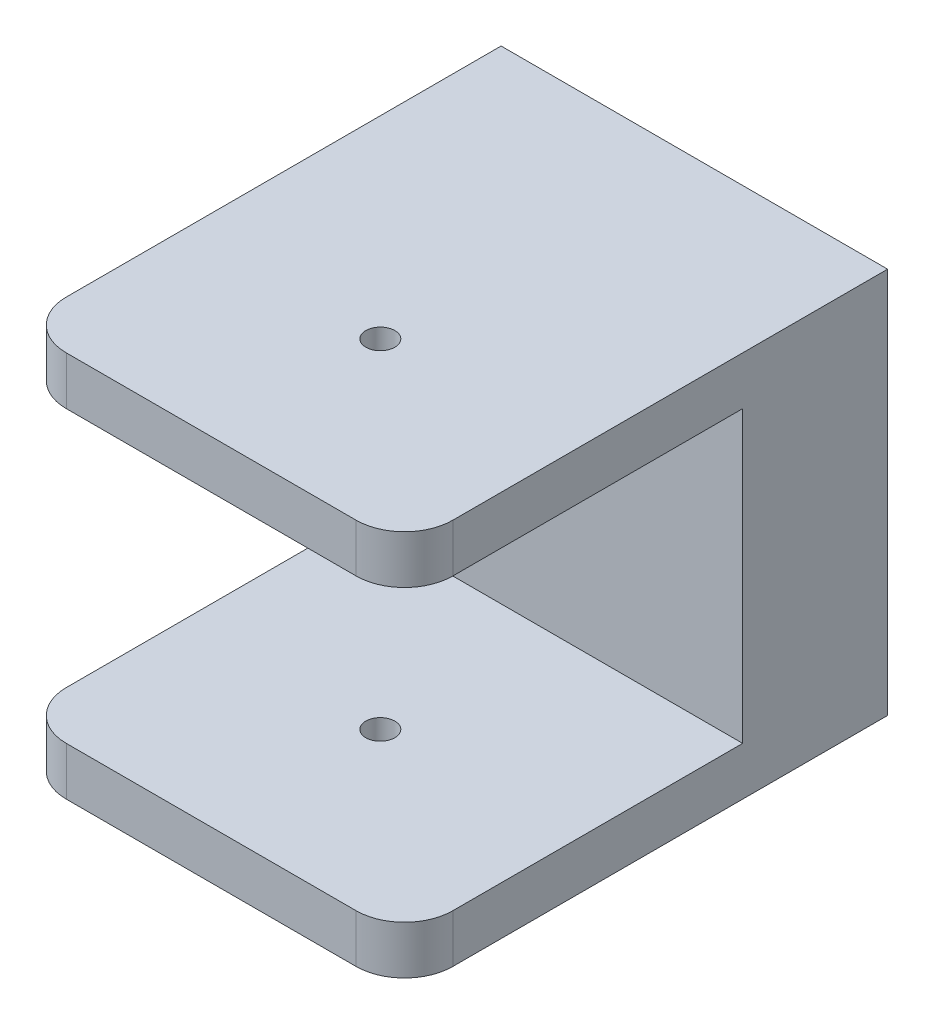
ISO-10303-21;
HEADER;
FILE_DESCRIPTION(('STEP AP214'),'2;1');
FILE_NAME('part.step','',(''),(''),'','','');
FILE_SCHEMA(('AUTOMOTIVE_DESIGN { 1 0 10303 214 1 1 1 1 }'));
ENDSEC;
DATA;
#1=APPLICATION_CONTEXT('core data for automotive mechanical design processes');
#2=APPLICATION_PROTOCOL_DEFINITION('international standard','automotive_design',2000,#1);
#3=PRODUCT_CONTEXT('',#1,'mechanical');
#4=PRODUCT('Part','Part','',(#3));
#5=PRODUCT_RELATED_PRODUCT_CATEGORY('part','',(#4));
#6=PRODUCT_DEFINITION_FORMATION('','',#4);
#7=PRODUCT_DEFINITION_CONTEXT('part definition',#1,'design');
#8=PRODUCT_DEFINITION('design','',#6,#7);
#9=PRODUCT_DEFINITION_SHAPE('','',#8);
#10=(LENGTH_UNIT() NAMED_UNIT(*) SI_UNIT(.MILLI.,.METRE.));
#11=(NAMED_UNIT(*) PLANE_ANGLE_UNIT() SI_UNIT($,.RADIAN.));
#12=(NAMED_UNIT(*) SI_UNIT($,.STERADIAN.) SOLID_ANGLE_UNIT());
#13=UNCERTAINTY_MEASURE_WITH_UNIT(LENGTH_MEASURE(1.E-05),#10,'distance_accuracy_value','');
#14=(GEOMETRIC_REPRESENTATION_CONTEXT(3) GLOBAL_UNCERTAINTY_ASSIGNED_CONTEXT((#13)) GLOBAL_UNIT_ASSIGNED_CONTEXT((#10,
#11,#12)) REPRESENTATION_CONTEXT('',''));
#15=CARTESIAN_POINT('',(0.,0.,0.));
#16=DIRECTION('',(0.,0.,1.));
#17=DIRECTION('',(1.,0.,0.));
#18=AXIS2_PLACEMENT_3D('',#15,#16,#17);
#19=CARTESIAN_POINT('',(0.,0.,100.));
#20=DIRECTION('',(0.,0.,-1.));
#21=DIRECTION('',(-1.,0.,0.));
#22=AXIS2_PLACEMENT_3D('',#19,#20,#21);
#23=PLANE('',#22);
#24=DIRECTION('',(-1.,0.,0.));
#25=VECTOR('',#24,1.);
#26=CARTESIAN_POINT('',(80.,70.,100.));
#27=LINE('',#26,#25);
#28=CARTESIAN_POINT('',(70.,70.,100.));
#29=VERTEX_POINT('',#28);
#30=CARTESIAN_POINT('',(9.99999999999998,70.,100.));
#31=VERTEX_POINT('',#30);
#32=EDGE_CURVE('E178',#29,#31,#27,.T.);
#33=ORIENTED_EDGE('',*,*,#32,.F.);
#34=DIRECTION('',(0.,1.,0.));
#35=VECTOR('',#34,1.);
#36=CARTESIAN_POINT('',(70.,0.,100.));
#37=LINE('',#36,#35);
#38=CARTESIAN_POINT('',(70.,80.,100.));
#39=VERTEX_POINT('',#38);
#40=EDGE_CURVE('E267',#29,#39,#37,.T.);
#41=ORIENTED_EDGE('',*,*,#40,.T.);
#42=DIRECTION('',(-1.,0.,0.));
#43=VECTOR('',#42,1.);
#44=CARTESIAN_POINT('',(0.,80.,100.));
#45=LINE('',#44,#43);
#46=CARTESIAN_POINT('',(9.99999999999998,80.,100.));
#47=VERTEX_POINT('',#46);
#48=EDGE_CURVE('E201',#39,#47,#45,.T.);
#49=ORIENTED_EDGE('',*,*,#48,.T.);
#50=DIRECTION('',(0.,-1.,0.));
#51=VECTOR('',#50,1.);
#52=CARTESIAN_POINT('',(10.,0.,100.));
#53=LINE('',#52,#51);
#54=EDGE_CURVE('E264',#47,#31,#53,.T.);
#55=ORIENTED_EDGE('',*,*,#54,.T.);
#56=EDGE_LOOP('',(#33,#41,#49,#55));
#57=FACE_BOUND('',#56,.T.);
#58=ADVANCED_FACE('F45',(#57),#23,.F.);
#59=DIRECTION('',(1.,0.,0.));
#60=VECTOR('',#59,1.);
#61=CARTESIAN_POINT('',(0.,0.,100.));
#62=LINE('',#61,#60);
#63=CARTESIAN_POINT('',(10.,0.,100.));
#64=VERTEX_POINT('',#63);
#65=CARTESIAN_POINT('',(70.,0.,100.));
#66=VERTEX_POINT('',#65);
#67=EDGE_CURVE('E197',#64,#66,#62,.T.);
#68=ORIENTED_EDGE('',*,*,#67,.T.);
#69=DIRECTION('',(0.,1.,0.));
#70=VECTOR('',#69,1.);
#71=CARTESIAN_POINT('',(70.,0.,100.));
#72=LINE('',#71,#70);
#73=CARTESIAN_POINT('',(70.,10.,100.));
#74=VERTEX_POINT('',#73);
#75=EDGE_CURVE('E242',#66,#74,#72,.T.);
#76=ORIENTED_EDGE('',*,*,#75,.T.);
#77=DIRECTION('',(1.,0.,0.));
#78=VECTOR('',#77,1.);
#79=CARTESIAN_POINT('',(0.,10.,100.));
#80=LINE('',#79,#78);
#81=CARTESIAN_POINT('',(10.,10.,100.));
#82=VERTEX_POINT('',#81);
#83=EDGE_CURVE('E165',#82,#74,#80,.T.);
#84=ORIENTED_EDGE('',*,*,#83,.F.);
#85=DIRECTION('',(0.,-1.,0.));
#86=VECTOR('',#85,1.);
#87=CARTESIAN_POINT('',(10.,0.,100.));
#88=LINE('',#87,#86);
#89=EDGE_CURVE('E229',#82,#64,#88,.T.);
#90=ORIENTED_EDGE('',*,*,#89,.T.);
#91=EDGE_LOOP('',(#68,#76,#84,#90));
#92=FACE_BOUND('',#91,.T.);
#93=ADVANCED_FACE('F297',(#92),#23,.F.);
#94=CARTESIAN_POINT('',(0.,0.,0.));
#95=DIRECTION('',(0.,0.,-1.));
#96=DIRECTION('',(-1.,0.,0.));
#97=AXIS2_PLACEMENT_3D('',#94,#95,#96);
#98=PLANE('',#97);
#99=DIRECTION('',(0.,-1.,0.));
#100=VECTOR('',#99,1.);
#101=CARTESIAN_POINT('',(0.,0.,0.));
#102=LINE('',#101,#100);
#103=CARTESIAN_POINT('',(0.,80.,0.));
#104=VERTEX_POINT('',#103);
#105=CARTESIAN_POINT('',(0.,0.,0.));
#106=VERTEX_POINT('',#105);
#107=EDGE_CURVE('E196',#104,#106,#102,.T.);
#108=ORIENTED_EDGE('',*,*,#107,.F.);
#109=DIRECTION('',(-1.,0.,0.));
#110=VECTOR('',#109,1.);
#111=CARTESIAN_POINT('',(0.,80.,0.));
#112=LINE('',#111,#110);
#113=CARTESIAN_POINT('',(80.,80.,0.));
#114=VERTEX_POINT('',#113);
#115=EDGE_CURVE('E202',#114,#104,#112,.T.);
#116=ORIENTED_EDGE('',*,*,#115,.F.);
#117=DIRECTION('',(0.,1.,0.));
#118=VECTOR('',#117,1.);
#119=CARTESIAN_POINT('',(80.,0.,0.));
#120=LINE('',#119,#118);
#121=CARTESIAN_POINT('',(80.,0.,0.));
#122=VERTEX_POINT('',#121);
#123=EDGE_CURVE('E212',#122,#114,#120,.T.);
#124=ORIENTED_EDGE('',*,*,#123,.F.);
#125=DIRECTION('',(1.,0.,0.));
#126=VECTOR('',#125,1.);
#127=CARTESIAN_POINT('',(0.,0.,0.));
#128=LINE('',#127,#126);
#129=EDGE_CURVE('E208',#106,#122,#128,.T.);
#130=ORIENTED_EDGE('',*,*,#129,.F.);
#131=EDGE_LOOP('',(#108,#116,#124,#130));
#132=FACE_BOUND('',#131,.T.);
#133=CARTESIAN_POINT('',(40.,40.,0.));
#134=DIRECTION('',(0.,0.,1.));
#135=DIRECTION('',(1.,0.,0.));
#136=AXIS2_PLACEMENT_3D('',#133,#134,#135);
#137=CIRCLE('',#136,3.);
#138=CARTESIAN_POINT('',(43.,40.,0.));
#139=VERTEX_POINT('',#138);
#140=EDGE_CURVE('E192',#139,#139,#137,.T.);
#141=ORIENTED_EDGE('',*,*,#140,.T.);
#142=EDGE_LOOP('',(#141));
#143=FACE_BOUND('',#142,.T.);
#144=ADVANCED_FACE('F285',(#132,#143),#98,.T.);
#145=CARTESIAN_POINT('',(0.,0.,100.));
#146=DIRECTION('',(1.,0.,0.));
#147=DIRECTION('',(0.,1.,0.));
#148=AXIS2_PLACEMENT_3D('',#145,#146,#147);
#149=PLANE('',#148);
#150=DIRECTION('',(0.,0.,-1.));
#151=VECTOR('',#150,1.);
#152=CARTESIAN_POINT('',(0.,0.,100.));
#153=LINE('',#152,#151);
#154=CARTESIAN_POINT('',(0.,0.,90.));
#155=VERTEX_POINT('',#154);
#156=EDGE_CURVE('E226',#155,#106,#153,.T.);
#157=ORIENTED_EDGE('',*,*,#156,.F.);
#158=DIRECTION('',(0.,-1.,0.));
#159=VECTOR('',#158,1.);
#160=CARTESIAN_POINT('',(0.,0.,90.));
#161=LINE('',#160,#159);
#162=CARTESIAN_POINT('',(0.,10.,90.));
#163=VERTEX_POINT('',#162);
#164=EDGE_CURVE('E261',#155,#163,#161,.F.);
#165=ORIENTED_EDGE('',*,*,#164,.T.);
#166=DIRECTION('',(0.,0.,1.));
#167=VECTOR('',#166,1.);
#168=CARTESIAN_POINT('',(0.,10.,30.));
#169=LINE('',#168,#167);
#170=CARTESIAN_POINT('',(0.,10.,30.));
#171=VERTEX_POINT('',#170);
#172=EDGE_CURVE('E154',#171,#163,#169,.T.);
#173=ORIENTED_EDGE('',*,*,#172,.F.);
#174=DIRECTION('',(0.,-1.,0.));
#175=VECTOR('',#174,1.);
#176=CARTESIAN_POINT('',(0.,10.,30.));
#177=LINE('',#176,#175);
#178=CARTESIAN_POINT('',(0.,70.,30.));
#179=VERTEX_POINT('',#178);
#180=EDGE_CURVE('E160',#179,#171,#177,.T.);
#181=ORIENTED_EDGE('',*,*,#180,.F.);
#182=DIRECTION('',(0.,0.,1.));
#183=VECTOR('',#182,1.);
#184=CARTESIAN_POINT('',(0.,70.,30.));
#185=LINE('',#184,#183);
#186=CARTESIAN_POINT('',(0.,70.,90.));
#187=VERTEX_POINT('',#186);
#188=EDGE_CURVE('E143',#179,#187,#185,.T.);
#189=ORIENTED_EDGE('',*,*,#188,.T.);
#190=DIRECTION('',(0.,-1.,0.));
#191=VECTOR('',#190,1.);
#192=CARTESIAN_POINT('',(0.,0.,90.));
#193=LINE('',#192,#191);
#194=CARTESIAN_POINT('',(0.,80.,90.));
#195=VERTEX_POINT('',#194);
#196=EDGE_CURVE('E259',#187,#195,#193,.F.);
#197=ORIENTED_EDGE('',*,*,#196,.T.);
#198=DIRECTION('',(0.,0.,-1.));
#199=VECTOR('',#198,1.);
#200=CARTESIAN_POINT('',(0.,80.,100.));
#201=LINE('',#200,#199);
#202=EDGE_CURVE('E204',#195,#104,#201,.T.);
#203=ORIENTED_EDGE('',*,*,#202,.T.);
#204=ORIENTED_EDGE('',*,*,#107,.T.);
#205=EDGE_LOOP('',(#157,#165,#173,#181,#189,#197,#203,#204));
#206=FACE_BOUND('',#205,.T.);
#207=ADVANCED_FACE('F168',(#206),#149,.F.);
#208=CARTESIAN_POINT('',(0.,0.,100.));
#209=DIRECTION('',(0.,1.,0.));
#210=DIRECTION('',(-1.,0.,0.));
#211=AXIS2_PLACEMENT_3D('',#208,#209,#210);
#212=PLANE('',#211);
#213=CARTESIAN_POINT('',(40.,0.,65.));
#214=DIRECTION('',(0.,1.,0.));
#215=DIRECTION('',(0.,0.,1.));
#216=AXIS2_PLACEMENT_3D('',#213,#214,#215);
#217=CIRCLE('',#216,3.);
#218=CARTESIAN_POINT('',(40.,0.,68.));
#219=VERTEX_POINT('',#218);
#220=EDGE_CURVE('E238',#219,#219,#217,.T.);
#221=ORIENTED_EDGE('',*,*,#220,.T.);
#222=EDGE_LOOP('',(#221));
#223=FACE_BOUND('',#222,.T.);
#224=DIRECTION('',(0.,0.,-1.));
#225=VECTOR('',#224,1.);
#226=CARTESIAN_POINT('',(80.,0.,100.));
#227=LINE('',#226,#225);
#228=CARTESIAN_POINT('',(80.,0.,90.));
#229=VERTEX_POINT('',#228);
#230=EDGE_CURVE('E223',#229,#122,#227,.T.);
#231=ORIENTED_EDGE('',*,*,#230,.F.);
#232=CARTESIAN_POINT('',(70.,0.,90.));
#233=DIRECTION('',(0.,1.,0.));
#234=DIRECTION('',(-1.,0.,0.));
#235=AXIS2_PLACEMENT_3D('',#232,#233,#234);
#236=CIRCLE('',#235,10.);
#237=EDGE_CURVE('E257',#229,#66,#236,.F.);
#238=ORIENTED_EDGE('',*,*,#237,.T.);
#239=ORIENTED_EDGE('',*,*,#67,.F.);
#240=CARTESIAN_POINT('',(10.,0.,90.));
#241=DIRECTION('',(0.,1.,0.));
#242=DIRECTION('',(-1.,0.,0.));
#243=AXIS2_PLACEMENT_3D('',#240,#241,#242);
#244=CIRCLE('',#243,10.);
#245=EDGE_CURVE('E254',#64,#155,#244,.F.);
#246=ORIENTED_EDGE('',*,*,#245,.T.);
#247=ORIENTED_EDGE('',*,*,#156,.T.);
#248=ORIENTED_EDGE('',*,*,#129,.T.);
#249=EDGE_LOOP('',(#231,#238,#239,#246,#247,#248));
#250=FACE_BOUND('',#249,.T.);
#251=ADVANCED_FACE('F306',(#223,#250),#212,.F.);
#252=CARTESIAN_POINT('',(80.,0.,100.));
#253=DIRECTION('',(-1.,0.,0.));
#254=DIRECTION('',(0.,0.,1.));
#255=AXIS2_PLACEMENT_3D('',#252,#253,#254);
#256=PLANE('',#255);
#257=DIRECTION('',(0.,0.,1.));
#258=VECTOR('',#257,1.);
#259=CARTESIAN_POINT('',(80.,10.,30.));
#260=LINE('',#259,#258);
#261=CARTESIAN_POINT('',(80.,10.,30.));
#262=VERTEX_POINT('',#261);
#263=CARTESIAN_POINT('',(80.,10.,90.));
#264=VERTEX_POINT('',#263);
#265=EDGE_CURVE('E187',#262,#264,#260,.T.);
#266=ORIENTED_EDGE('',*,*,#265,.T.);
#267=DIRECTION('',(0.,1.,0.));
#268=VECTOR('',#267,1.);
#269=CARTESIAN_POINT('',(80.,0.,90.));
#270=LINE('',#269,#268);
#271=EDGE_CURVE('E252',#264,#229,#270,.F.);
#272=ORIENTED_EDGE('',*,*,#271,.T.);
#273=ORIENTED_EDGE('',*,*,#230,.T.);
#274=ORIENTED_EDGE('',*,*,#123,.T.);
#275=DIRECTION('',(0.,0.,-1.));
#276=VECTOR('',#275,1.);
#277=CARTESIAN_POINT('',(80.,80.,100.));
#278=LINE('',#277,#276);
#279=CARTESIAN_POINT('',(80.,80.,90.));
#280=VERTEX_POINT('',#279);
#281=EDGE_CURVE('E221',#280,#114,#278,.T.);
#282=ORIENTED_EDGE('',*,*,#281,.F.);
#283=DIRECTION('',(0.,1.,0.));
#284=VECTOR('',#283,1.);
#285=CARTESIAN_POINT('',(80.,0.,90.));
#286=LINE('',#285,#284);
#287=CARTESIAN_POINT('',(80.,70.,90.));
#288=VERTEX_POINT('',#287);
#289=EDGE_CURVE('E250',#280,#288,#286,.F.);
#290=ORIENTED_EDGE('',*,*,#289,.T.);
#291=DIRECTION('',(0.,0.,1.));
#292=VECTOR('',#291,1.);
#293=CARTESIAN_POINT('',(80.,70.,30.));
#294=LINE('',#293,#292);
#295=CARTESIAN_POINT('',(80.,70.,30.));
#296=VERTEX_POINT('',#295);
#297=EDGE_CURVE('E184',#296,#288,#294,.T.);
#298=ORIENTED_EDGE('',*,*,#297,.F.);
#299=DIRECTION('',(0.,1.,0.));
#300=VECTOR('',#299,1.);
#301=CARTESIAN_POINT('',(80.,10.,30.));
#302=LINE('',#301,#300);
#303=EDGE_CURVE('E155',#262,#296,#302,.T.);
#304=ORIENTED_EDGE('',*,*,#303,.F.);
#305=EDGE_LOOP('',(#266,#272,#273,#274,#282,#290,#298,#304));
#306=FACE_BOUND('',#305,.T.);
#307=ADVANCED_FACE('F273',(#306),#256,.F.);
#308=CARTESIAN_POINT('',(0.,80.,100.));
#309=DIRECTION('',(0.,-1.,0.));
#310=DIRECTION('',(1.,0.,0.));
#311=AXIS2_PLACEMENT_3D('',#308,#309,#310);
#312=PLANE('',#311);
#313=CARTESIAN_POINT('',(40.,80.,65.));
#314=DIRECTION('',(0.,-1.,0.));
#315=DIRECTION('',(1.,0.,0.));
#316=AXIS2_PLACEMENT_3D('',#313,#314,#315);
#317=CIRCLE('',#316,3.);
#318=CARTESIAN_POINT('',(43.,80.,65.));
#319=VERTEX_POINT('',#318);
#320=EDGE_CURVE('E180',#319,#319,#317,.T.);
#321=ORIENTED_EDGE('',*,*,#320,.T.);
#322=EDGE_LOOP('',(#321));
#323=FACE_BOUND('',#322,.T.);
#324=ORIENTED_EDGE('',*,*,#48,.F.);
#325=CARTESIAN_POINT('',(70.,80.,90.));
#326=DIRECTION('',(0.,-1.,0.));
#327=DIRECTION('',(1.,0.,0.));
#328=AXIS2_PLACEMENT_3D('',#325,#326,#327);
#329=CIRCLE('',#328,10.);
#330=EDGE_CURVE('E68',#39,#280,#329,.F.);
#331=ORIENTED_EDGE('',*,*,#330,.T.);
#332=ORIENTED_EDGE('',*,*,#281,.T.);
#333=ORIENTED_EDGE('',*,*,#115,.T.);
#334=ORIENTED_EDGE('',*,*,#202,.F.);
#335=CARTESIAN_POINT('',(9.99999999999998,80.,90.));
#336=DIRECTION('',(0.,-1.,0.));
#337=DIRECTION('',(1.,0.,0.));
#338=AXIS2_PLACEMENT_3D('',#335,#336,#337);
#339=CIRCLE('',#338,10.);
#340=EDGE_CURVE('E60',#195,#47,#339,.F.);
#341=ORIENTED_EDGE('',*,*,#340,.T.);
#342=EDGE_LOOP('',(#324,#331,#332,#333,#334,#341));
#343=FACE_BOUND('',#342,.T.);
#344=ADVANCED_FACE('F271',(#323,#343),#312,.F.);
#345=CARTESIAN_POINT('',(40.,40.,100.));
#346=DIRECTION('',(0.,0.,-1.));
#347=DIRECTION('',(-1.,0.,0.));
#348=AXIS2_PLACEMENT_3D('',#345,#346,#347);
#349=CYLINDRICAL_SURFACE('',#348,3.);
#350=CARTESIAN_POINT('',(40.,40.,30.));
#351=DIRECTION('',(0.,0.,-1.));
#352=DIRECTION('',(-1.,0.,0.));
#353=AXIS2_PLACEMENT_3D('',#350,#351,#352);
#354=CIRCLE('',#353,3.);
#355=CARTESIAN_POINT('',(37.,40.,30.));
#356=VERTEX_POINT('',#355);
#357=EDGE_CURVE('E186',#356,#356,#354,.T.);
#358=ORIENTED_EDGE('',*,*,#357,.F.);
#359=EDGE_LOOP('',(#358));
#360=FACE_BOUND('',#359,.T.);
#361=ORIENTED_EDGE('',*,*,#140,.F.);
#362=EDGE_LOOP('',(#361));
#363=FACE_BOUND('',#362,.T.);
#364=ADVANCED_FACE('F326',(#360,#363),#349,.F.);
#365=CARTESIAN_POINT('',(80.,70.,30.));
#366=DIRECTION('',(0.,1.,0.));
#367=DIRECTION('',(0.,0.,1.));
#368=AXIS2_PLACEMENT_3D('',#365,#366,#367);
#369=PLANE('',#368);
#370=CARTESIAN_POINT('',(40.,70.,65.));
#371=DIRECTION('',(0.,1.,0.));
#372=DIRECTION('',(0.,0.,1.));
#373=AXIS2_PLACEMENT_3D('',#370,#371,#372);
#374=CIRCLE('',#373,3.);
#375=CARTESIAN_POINT('',(40.,70.,68.));
#376=VERTEX_POINT('',#375);
#377=EDGE_CURVE('E237',#376,#376,#374,.T.);
#378=ORIENTED_EDGE('',*,*,#377,.T.);
#379=EDGE_LOOP('',(#378));
#380=FACE_BOUND('',#379,.T.);
#381=ORIENTED_EDGE('',*,*,#297,.T.);
#382=CARTESIAN_POINT('',(70.,70.,90.));
#383=DIRECTION('',(0.,1.,0.));
#384=DIRECTION('',(0.,0.,1.));
#385=AXIS2_PLACEMENT_3D('',#382,#383,#384);
#386=CIRCLE('',#385,10.);
#387=EDGE_CURVE('E11',#288,#29,#386,.F.);
#388=ORIENTED_EDGE('',*,*,#387,.T.);
#389=ORIENTED_EDGE('',*,*,#32,.T.);
#390=CARTESIAN_POINT('',(9.99999999999998,70.,90.));
#391=DIRECTION('',(0.,1.,0.));
#392=DIRECTION('',(0.,0.,1.));
#393=AXIS2_PLACEMENT_3D('',#390,#391,#392);
#394=CIRCLE('',#393,10.);
#395=EDGE_CURVE('E53',#31,#187,#394,.F.);
#396=ORIENTED_EDGE('',*,*,#395,.T.);
#397=ORIENTED_EDGE('',*,*,#188,.F.);
#398=DIRECTION('',(-1.,0.,0.));
#399=VECTOR('',#398,1.);
#400=CARTESIAN_POINT('',(80.,70.,30.));
#401=LINE('',#400,#399);
#402=EDGE_CURVE('E147',#296,#179,#401,.T.);
#403=ORIENTED_EDGE('',*,*,#402,.F.);
#404=EDGE_LOOP('',(#381,#388,#389,#396,#397,#403));
#405=FACE_BOUND('',#404,.T.);
#406=ADVANCED_FACE('F146',(#380,#405),#369,.F.);
#407=CARTESIAN_POINT('',(0.,10.,30.));
#408=DIRECTION('',(0.,-1.,0.));
#409=DIRECTION('',(1.,0.,0.));
#410=AXIS2_PLACEMENT_3D('',#407,#408,#409);
#411=PLANE('',#410);
#412=CARTESIAN_POINT('',(40.,10.,65.));
#413=DIRECTION('',(0.,-1.,0.));
#414=DIRECTION('',(1.,0.,0.));
#415=AXIS2_PLACEMENT_3D('',#412,#413,#414);
#416=CIRCLE('',#415,3.);
#417=CARTESIAN_POINT('',(43.,10.,65.));
#418=VERTEX_POINT('',#417);
#419=EDGE_CURVE('E233',#418,#418,#416,.T.);
#420=ORIENTED_EDGE('',*,*,#419,.T.);
#421=EDGE_LOOP('',(#420));
#422=FACE_BOUND('',#421,.T.);
#423=ORIENTED_EDGE('',*,*,#83,.T.);
#424=CARTESIAN_POINT('',(70.,10.,90.));
#425=DIRECTION('',(0.,-1.,0.));
#426=DIRECTION('',(1.,0.,0.));
#427=AXIS2_PLACEMENT_3D('',#424,#425,#426);
#428=CIRCLE('',#427,10.);
#429=EDGE_CURVE('E248',#74,#264,#428,.F.);
#430=ORIENTED_EDGE('',*,*,#429,.T.);
#431=ORIENTED_EDGE('',*,*,#265,.F.);
#432=DIRECTION('',(1.,0.,0.));
#433=VECTOR('',#432,1.);
#434=CARTESIAN_POINT('',(0.,10.,30.));
#435=LINE('',#434,#433);
#436=EDGE_CURVE('E171',#171,#262,#435,.T.);
#437=ORIENTED_EDGE('',*,*,#436,.F.);
#438=ORIENTED_EDGE('',*,*,#172,.T.);
#439=CARTESIAN_POINT('',(10.,10.,90.));
#440=DIRECTION('',(0.,-1.,0.));
#441=DIRECTION('',(1.,0.,0.));
#442=AXIS2_PLACEMENT_3D('',#439,#440,#441);
#443=CIRCLE('',#442,10.);
#444=EDGE_CURVE('E245',#163,#82,#443,.F.);
#445=ORIENTED_EDGE('',*,*,#444,.T.);
#446=EDGE_LOOP('',(#423,#430,#431,#437,#438,#445));
#447=FACE_BOUND('',#446,.T.);
#448=ADVANCED_FACE('F295',(#422,#447),#411,.F.);
#449=CARTESIAN_POINT('',(0.,0.,30.));
#450=DIRECTION('',(0.,0.,-1.));
#451=DIRECTION('',(-1.,0.,0.));
#452=AXIS2_PLACEMENT_3D('',#449,#450,#451);
#453=PLANE('',#452);
#454=ORIENTED_EDGE('',*,*,#357,.T.);
#455=EDGE_LOOP('',(#454));
#456=FACE_BOUND('',#455,.T.);
#457=ORIENTED_EDGE('',*,*,#402,.T.);
#458=ORIENTED_EDGE('',*,*,#180,.T.);
#459=ORIENTED_EDGE('',*,*,#436,.T.);
#460=ORIENTED_EDGE('',*,*,#303,.T.);
#461=EDGE_LOOP('',(#457,#458,#459,#460));
#462=FACE_BOUND('',#461,.T.);
#463=ADVANCED_FACE('F159',(#456,#462),#453,.F.);
#464=CARTESIAN_POINT('',(40.,0.,65.));
#465=DIRECTION('',(0.,1.,0.));
#466=DIRECTION('',(0.,0.,1.));
#467=AXIS2_PLACEMENT_3D('',#464,#465,#466);
#468=CYLINDRICAL_SURFACE('',#467,3.);
#469=ORIENTED_EDGE('',*,*,#220,.F.);
#470=EDGE_LOOP('',(#469));
#471=FACE_BOUND('',#470,.T.);
#472=ORIENTED_EDGE('',*,*,#419,.F.);
#473=EDGE_LOOP('',(#472));
#474=FACE_BOUND('',#473,.T.);
#475=ADVANCED_FACE('F345',(#471,#474),#468,.F.);
#476=ORIENTED_EDGE('',*,*,#377,.F.);
#477=EDGE_LOOP('',(#476));
#478=FACE_BOUND('',#477,.T.);
#479=ORIENTED_EDGE('',*,*,#320,.F.);
#480=EDGE_LOOP('',(#479));
#481=FACE_BOUND('',#480,.T.);
#482=ADVANCED_FACE('F348',(#478,#481),#468,.F.);
#483=CARTESIAN_POINT('',(70.,0.,90.));
#484=DIRECTION('',(0.,1.,0.));
#485=DIRECTION('',(0.,0.,1.));
#486=AXIS2_PLACEMENT_3D('',#483,#484,#485);
#487=CYLINDRICAL_SURFACE('',#486,10.);
#488=ORIENTED_EDGE('',*,*,#237,.F.);
#489=ORIENTED_EDGE('',*,*,#271,.F.);
#490=ORIENTED_EDGE('',*,*,#429,.F.);
#491=ORIENTED_EDGE('',*,*,#75,.F.);
#492=EDGE_LOOP('',(#488,#489,#490,#491));
#493=FACE_BOUND('',#492,.T.);
#494=ADVANCED_FACE('F302',(#493),#487,.T.);
#495=CARTESIAN_POINT('',(10.,0.,90.));
#496=DIRECTION('',(0.,-1.,0.));
#497=DIRECTION('',(1.,0.,0.));
#498=AXIS2_PLACEMENT_3D('',#495,#496,#497);
#499=CYLINDRICAL_SURFACE('',#498,10.);
#500=ORIENTED_EDGE('',*,*,#444,.F.);
#501=ORIENTED_EDGE('',*,*,#164,.F.);
#502=ORIENTED_EDGE('',*,*,#245,.F.);
#503=ORIENTED_EDGE('',*,*,#89,.F.);
#504=EDGE_LOOP('',(#500,#501,#502,#503));
#505=FACE_BOUND('',#504,.T.);
#506=ADVANCED_FACE('F291',(#505),#499,.T.);
#507=CARTESIAN_POINT('',(70.,0.,90.));
#508=DIRECTION('',(0.,1.,0.));
#509=DIRECTION('',(0.,0.,1.));
#510=AXIS2_PLACEMENT_3D('',#507,#508,#509);
#511=CYLINDRICAL_SURFACE('',#510,10.);
#512=ORIENTED_EDGE('',*,*,#387,.F.);
#513=ORIENTED_EDGE('',*,*,#289,.F.);
#514=ORIENTED_EDGE('',*,*,#330,.F.);
#515=ORIENTED_EDGE('',*,*,#40,.F.);
#516=EDGE_LOOP('',(#512,#513,#514,#515));
#517=FACE_BOUND('',#516,.T.);
#518=ADVANCED_FACE('F277',(#517),#511,.T.);
#519=CARTESIAN_POINT('',(10.,0.,90.));
#520=DIRECTION('',(0.,-1.,0.));
#521=DIRECTION('',(1.,0.,0.));
#522=AXIS2_PLACEMENT_3D('',#519,#520,#521);
#523=CYLINDRICAL_SURFACE('',#522,10.);
#524=ORIENTED_EDGE('',*,*,#340,.F.);
#525=ORIENTED_EDGE('',*,*,#196,.F.);
#526=ORIENTED_EDGE('',*,*,#395,.F.);
#527=ORIENTED_EDGE('',*,*,#54,.F.);
#528=EDGE_LOOP('',(#524,#525,#526,#527));
#529=FACE_BOUND('',#528,.T.);
#530=ADVANCED_FACE('F47',(#529),#523,.T.);
#531=CLOSED_SHELL('',(#58,#93,#144,#207,#251,#307,#344,#364,#406,#448,#463,#475,#482,#494,#506,
#518,#530));
#532=MANIFOLD_SOLID_BREP('B2',#531);
#533=ADVANCED_BREP_SHAPE_REPRESENTATION('',(#18,#532),#14);
#534=SHAPE_DEFINITION_REPRESENTATION(#9,#533);
ENDSEC;
END-ISO-10303-21;
